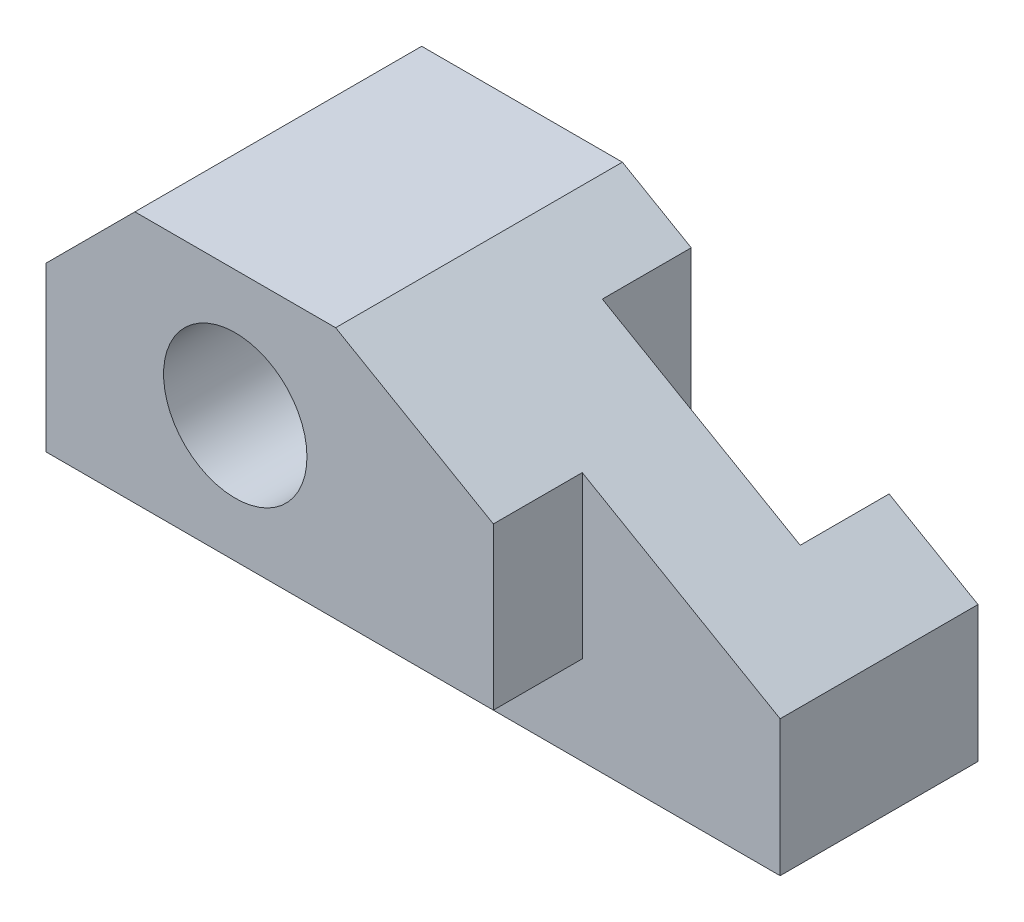
ISO-10303-21;
HEADER;
FILE_DESCRIPTION(('STEP AP214'),'2;1');
FILE_NAME('part.step','',(''),(''),'','','');
FILE_SCHEMA(('AUTOMOTIVE_DESIGN { 1 0 10303 214 1 1 1 1 }'));
ENDSEC;
DATA;
#1=APPLICATION_CONTEXT('core data for automotive mechanical design processes');
#2=APPLICATION_PROTOCOL_DEFINITION('international standard','automotive_design',2000,#1);
#3=PRODUCT_CONTEXT('',#1,'mechanical');
#4=PRODUCT('Part','Part','',(#3));
#5=PRODUCT_RELATED_PRODUCT_CATEGORY('part','',(#4));
#6=PRODUCT_DEFINITION_FORMATION('','',#4);
#7=PRODUCT_DEFINITION_CONTEXT('part definition',#1,'design');
#8=PRODUCT_DEFINITION('design','',#6,#7);
#9=PRODUCT_DEFINITION_SHAPE('','',#8);
#10=(LENGTH_UNIT() NAMED_UNIT(*) SI_UNIT(.MILLI.,.METRE.));
#11=(NAMED_UNIT(*) PLANE_ANGLE_UNIT() SI_UNIT($,.RADIAN.));
#12=(NAMED_UNIT(*) SI_UNIT($,.STERADIAN.) SOLID_ANGLE_UNIT());
#13=UNCERTAINTY_MEASURE_WITH_UNIT(LENGTH_MEASURE(1.E-05),#10,'distance_accuracy_value','');
#14=(GEOMETRIC_REPRESENTATION_CONTEXT(3) GLOBAL_UNCERTAINTY_ASSIGNED_CONTEXT((#13)) GLOBAL_UNIT_ASSIGNED_CONTEXT((#10,
#11,#12)) REPRESENTATION_CONTEXT('',''));
#15=CARTESIAN_POINT('',(0.,0.,0.));
#16=DIRECTION('',(0.,0.,1.));
#17=DIRECTION('',(1.,0.,0.));
#18=AXIS2_PLACEMENT_3D('',#15,#16,#17);
#19=CARTESIAN_POINT('',(0.,0.,-25.4));
#20=DIRECTION('',(0.,0.,1.));
#21=DIRECTION('',(1.,0.,0.));
#22=AXIS2_PLACEMENT_3D('',#19,#20,#21);
#23=PLANE('',#22);
#24=DIRECTION('',(1.,0.,0.));
#25=VECTOR('',#24,1.);
#26=CARTESIAN_POINT('',(0.,0.,-25.4));
#27=LINE('',#26,#25);
#28=CARTESIAN_POINT('',(65.024,0.,-25.4));
#29=VERTEX_POINT('',#28);
#30=CARTESIAN_POINT('',(80.772,0.,-25.4));
#31=VERTEX_POINT('',#30);
#32=EDGE_CURVE('E207',#29,#31,#27,.T.);
#33=ORIENTED_EDGE('',*,*,#32,.F.);
#34=DIRECTION('',(0.,1.,0.));
#35=VECTOR('',#34,1.);
#36=CARTESIAN_POINT('',(65.024,0.,-25.4));
#37=LINE('',#36,#35);
#38=CARTESIAN_POINT('',(65.024,33.1756638824052,-25.4));
#39=VERTEX_POINT('',#38);
#40=EDGE_CURVE('E49',#29,#39,#37,.T.);
#41=ORIENTED_EDGE('',*,*,#40,.T.);
#42=DIRECTION('',(-0.866025403784438,0.500000000000001,0.));
#43=VECTOR('',#42,1.);
#44=CARTESIAN_POINT('',(30.6214838547885,53.0379658396436,-25.4));
#45=LINE('',#44,#43);
#46=CARTESIAN_POINT('',(80.772,24.083551843207,-25.4));
#47=VERTEX_POINT('',#46);
#48=EDGE_CURVE('E213',#47,#39,#45,.T.);
#49=ORIENTED_EDGE('',*,*,#48,.F.);
#50=DIRECTION('',(0.,1.,0.));
#51=VECTOR('',#50,1.);
#52=CARTESIAN_POINT('',(80.772,0.,-25.4));
#53=LINE('',#52,#51);
#54=EDGE_CURVE('E209',#31,#47,#53,.T.);
#55=ORIENTED_EDGE('',*,*,#54,.F.);
#56=EDGE_LOOP('',(#33,#41,#49,#55));
#57=FACE_BOUND('',#56,.T.);
#58=ADVANCED_FACE('F41',(#57),#23,.F.);
#59=CARTESIAN_POINT('',(-33.528,0.,25.4));
#60=DIRECTION('',(1.,0.,0.));
#61=DIRECTION('',(0.,1.,0.));
#62=AXIS2_PLACEMENT_3D('',#59,#60,#61);
#63=PLANE('',#62);
#64=DIRECTION('',(0.,0.,1.));
#65=VECTOR('',#64,1.);
#66=CARTESIAN_POINT('',(-33.528,15.748,9.652));
#67=LINE('',#66,#65);
#68=CARTESIAN_POINT('',(-33.528,15.748,9.652));
#69=VERTEX_POINT('',#68);
#70=CARTESIAN_POINT('',(-33.528,15.748,25.4));
#71=VERTEX_POINT('',#70);
#72=EDGE_CURVE('E184',#69,#71,#67,.T.);
#73=ORIENTED_EDGE('',*,*,#72,.T.);
#74=DIRECTION('',(0.,-1.,0.));
#75=VECTOR('',#74,1.);
#76=CARTESIAN_POINT('',(-33.528,0.,25.4));
#77=LINE('',#76,#75);
#78=CARTESIAN_POINT('',(-33.528,44.7039999999999,25.4));
#79=VERTEX_POINT('',#78);
#80=EDGE_CURVE('E191',#79,#71,#77,.T.);
#81=ORIENTED_EDGE('',*,*,#80,.F.);
#82=DIRECTION('',(0.,0.,-1.));
#83=VECTOR('',#82,1.);
#84=CARTESIAN_POINT('',(-33.528,44.7039999999999,25.4));
#85=LINE('',#84,#83);
#86=CARTESIAN_POINT('',(-33.528,44.7039999999999,-25.4));
#87=VERTEX_POINT('',#86);
#88=EDGE_CURVE('E201',#79,#87,#85,.T.);
#89=ORIENTED_EDGE('',*,*,#88,.T.);
#90=DIRECTION('',(0.,-1.,0.));
#91=VECTOR('',#90,1.);
#92=CARTESIAN_POINT('',(-33.528,0.,-25.4));
#93=LINE('',#92,#91);
#94=CARTESIAN_POINT('',(-33.528,0.,-25.4));
#95=VERTEX_POINT('',#94);
#96=EDGE_CURVE('E204',#87,#95,#93,.T.);
#97=ORIENTED_EDGE('',*,*,#96,.T.);
#98=DIRECTION('',(0.,0.,-1.));
#99=VECTOR('',#98,1.);
#100=CARTESIAN_POINT('',(-33.528,0.,25.4));
#101=LINE('',#100,#99);
#102=CARTESIAN_POINT('',(-33.528,0.,9.652));
#103=VERTEX_POINT('',#102);
#104=EDGE_CURVE('E232',#103,#95,#101,.T.);
#105=ORIENTED_EDGE('',*,*,#104,.F.);
#106=DIRECTION('',(0.,-1.,0.));
#107=VECTOR('',#106,1.);
#108=CARTESIAN_POINT('',(-33.528,0.,9.652));
#109=LINE('',#108,#107);
#110=EDGE_CURVE('E168',#69,#103,#109,.T.);
#111=ORIENTED_EDGE('',*,*,#110,.F.);
#112=EDGE_LOOP('',(#73,#81,#89,#97,#105,#111));
#113=FACE_BOUND('',#112,.T.);
#114=ADVANCED_FACE('F264',(#113),#63,.F.);
#115=CARTESIAN_POINT('',(0.,0.,25.4));
#116=DIRECTION('',(0.,1.,0.));
#117=DIRECTION('',(0.,0.,1.));
#118=AXIS2_PLACEMENT_3D('',#115,#116,#117);
#119=PLANE('',#118);
#120=DIRECTION('',(1.,0.,0.));
#121=VECTOR('',#120,1.);
#122=CARTESIAN_POINT('',(0.,0.,-9.652));
#123=LINE('',#122,#121);
#124=CARTESIAN_POINT('',(29.972,0.,-9.652));
#125=VERTEX_POINT('',#124);
#126=CARTESIAN_POINT('',(65.024,0.,-9.652));
#127=VERTEX_POINT('',#126);
#128=EDGE_CURVE('E139',#125,#127,#123,.T.);
#129=ORIENTED_EDGE('',*,*,#128,.T.);
#130=DIRECTION('',(0.,0.,-1.));
#131=VECTOR('',#130,1.);
#132=CARTESIAN_POINT('',(65.024,0.,25.4));
#133=LINE('',#132,#131);
#134=EDGE_CURVE('E146',#127,#29,#133,.T.);
#135=ORIENTED_EDGE('',*,*,#134,.T.);
#136=ORIENTED_EDGE('',*,*,#32,.T.);
#137=DIRECTION('',(0.,0.,-1.));
#138=VECTOR('',#137,1.);
#139=CARTESIAN_POINT('',(80.772,0.,25.4));
#140=LINE('',#139,#138);
#141=CARTESIAN_POINT('',(80.772,0.,9.652));
#142=VERTEX_POINT('',#141);
#143=EDGE_CURVE('E229',#142,#31,#140,.T.);
#144=ORIENTED_EDGE('',*,*,#143,.F.);
#145=DIRECTION('',(1.,0.,0.));
#146=VECTOR('',#145,1.);
#147=CARTESIAN_POINT('',(0.,0.,9.652));
#148=LINE('',#147,#146);
#149=EDGE_CURVE('E170',#103,#142,#148,.T.);
#150=ORIENTED_EDGE('',*,*,#149,.F.);
#151=ORIENTED_EDGE('',*,*,#104,.T.);
#152=CARTESIAN_POINT('',(29.972,0.,-25.4));
#153=VERTEX_POINT('',#152);
#154=EDGE_CURVE('E155',#95,#153,#27,.T.);
#155=ORIENTED_EDGE('',*,*,#154,.T.);
#156=DIRECTION('',(0.,0.,1.));
#157=VECTOR('',#156,1.);
#158=CARTESIAN_POINT('',(29.972,0.,25.4));
#159=LINE('',#158,#157);
#160=EDGE_CURVE('E56',#153,#125,#159,.T.);
#161=ORIENTED_EDGE('',*,*,#160,.T.);
#162=EDGE_LOOP('',(#129,#135,#136,#144,#150,#151,#155,#161));
#163=FACE_BOUND('',#162,.T.);
#164=ADVANCED_FACE('F153',(#163),#119,.F.);
#165=CARTESIAN_POINT('',(80.772,0.,25.4));
#166=DIRECTION('',(-1.,0.,0.));
#167=DIRECTION('',(0.,0.,1.));
#168=AXIS2_PLACEMENT_3D('',#165,#166,#167);
#169=PLANE('',#168);
#170=DIRECTION('',(0.,1.,0.));
#171=VECTOR('',#170,1.);
#172=CARTESIAN_POINT('',(80.772,0.,9.652));
#173=LINE('',#172,#171);
#174=CARTESIAN_POINT('',(80.772,24.083551843207,9.652));
#175=VERTEX_POINT('',#174);
#176=EDGE_CURVE('E172',#142,#175,#173,.T.);
#177=ORIENTED_EDGE('',*,*,#176,.F.);
#178=ORIENTED_EDGE('',*,*,#143,.T.);
#179=ORIENTED_EDGE('',*,*,#54,.T.);
#180=DIRECTION('',(0.,0.,-1.));
#181=VECTOR('',#180,1.);
#182=CARTESIAN_POINT('',(80.772,24.083551843207,25.4));
#183=LINE('',#182,#181);
#184=EDGE_CURVE('E227',#175,#47,#183,.T.);
#185=ORIENTED_EDGE('',*,*,#184,.F.);
#186=EDGE_LOOP('',(#177,#178,#179,#185));
#187=FACE_BOUND('',#186,.T.);
#188=ADVANCED_FACE('F248',(#187),#169,.F.);
#189=CARTESIAN_POINT('',(30.6214838547885,53.0379658396436,25.4));
#190=DIRECTION('',(-0.500000000000001,-0.866025403784438,0.));
#191=DIRECTION('',(0.866025403784438,-0.500000000000001,0.));
#192=AXIS2_PLACEMENT_3D('',#189,#190,#191);
#193=PLANE('',#192);
#194=ORIENTED_EDGE('',*,*,#48,.T.);
#195=DIRECTION('',(0.,0.,1.));
#196=VECTOR('',#195,1.);
#197=CARTESIAN_POINT('',(65.024,33.1756638824052,25.4));
#198=LINE('',#197,#196);
#199=CARTESIAN_POINT('',(65.024,33.1756638824052,-9.652));
#200=VERTEX_POINT('',#199);
#201=EDGE_CURVE('E156',#39,#200,#198,.T.);
#202=ORIENTED_EDGE('',*,*,#201,.T.);
#203=DIRECTION('',(-0.866025403784438,0.500000000000001,0.));
#204=VECTOR('',#203,1.);
#205=CARTESIAN_POINT('',(30.6214838547885,53.0379658396436,-9.652));
#206=LINE('',#205,#204);
#207=CARTESIAN_POINT('',(29.972,53.41294551804,-9.652));
#208=VERTEX_POINT('',#207);
#209=EDGE_CURVE('E11',#200,#208,#206,.T.);
#210=ORIENTED_EDGE('',*,*,#209,.T.);
#211=DIRECTION('',(0.,0.,-1.));
#212=VECTOR('',#211,1.);
#213=CARTESIAN_POINT('',(29.972,53.4129455180401,25.4));
#214=LINE('',#213,#212);
#215=CARTESIAN_POINT('',(29.972,53.41294551804,-25.4));
#216=VERTEX_POINT('',#215);
#217=EDGE_CURVE('E150',#208,#216,#214,.T.);
#218=ORIENTED_EDGE('',*,*,#217,.T.);
#219=CARTESIAN_POINT('',(17.78,60.452,-25.4));
#220=VERTEX_POINT('',#219);
#221=EDGE_CURVE('E212',#216,#220,#45,.T.);
#222=ORIENTED_EDGE('',*,*,#221,.T.);
#223=DIRECTION('',(0.,0.,-1.));
#224=VECTOR('',#223,1.);
#225=CARTESIAN_POINT('',(17.78,60.452,25.4));
#226=LINE('',#225,#224);
#227=CARTESIAN_POINT('',(17.78,60.452,25.4));
#228=VERTEX_POINT('',#227);
#229=EDGE_CURVE('E224',#228,#220,#226,.T.);
#230=ORIENTED_EDGE('',*,*,#229,.F.);
#231=DIRECTION('',(-0.866025403784438,0.500000000000001,0.));
#232=VECTOR('',#231,1.);
#233=CARTESIAN_POINT('',(30.6214838547885,53.0379658396436,25.4));
#234=LINE('',#233,#232);
#235=CARTESIAN_POINT('',(45.72,44.3208334788418,25.4));
#236=VERTEX_POINT('',#235);
#237=EDGE_CURVE('E195',#236,#228,#234,.T.);
#238=ORIENTED_EDGE('',*,*,#237,.F.);
#239=DIRECTION('',(0.,0.,1.));
#240=VECTOR('',#239,1.);
#241=CARTESIAN_POINT('',(45.72,44.3208334788418,9.652));
#242=LINE('',#241,#240);
#243=CARTESIAN_POINT('',(45.72,44.3208334788418,9.652));
#244=VERTEX_POINT('',#243);
#245=EDGE_CURVE('E181',#244,#236,#242,.T.);
#246=ORIENTED_EDGE('',*,*,#245,.F.);
#247=DIRECTION('',(-0.866025403784438,0.500000000000001,0.));
#248=VECTOR('',#247,1.);
#249=CARTESIAN_POINT('',(30.6214838547885,53.0379658396436,9.652));
#250=LINE('',#249,#248);
#251=EDGE_CURVE('E174',#175,#244,#250,.T.);
#252=ORIENTED_EDGE('',*,*,#251,.F.);
#253=ORIENTED_EDGE('',*,*,#184,.T.);
#254=EDGE_LOOP('',(#194,#202,#210,#218,#222,#230,#238,#246,#252,#253));
#255=FACE_BOUND('',#254,.T.);
#256=ADVANCED_FACE('F242',(#255),#193,.F.);
#257=CARTESIAN_POINT('',(0.,0.,25.4));
#258=DIRECTION('',(0.,0.,1.));
#259=DIRECTION('',(1.,0.,0.));
#260=AXIS2_PLACEMENT_3D('',#257,#258,#259);
#261=PLANE('',#260);
#262=CARTESIAN_POINT('',(0.,38.1,25.4));
#263=DIRECTION('',(0.,0.,1.));
#264=DIRECTION('',(1.,0.,0.));
#265=AXIS2_PLACEMENT_3D('',#262,#263,#264);
#266=CIRCLE('',#265,12.7);
#267=CARTESIAN_POINT('',(12.7,38.1,25.4));
#268=VERTEX_POINT('',#267);
#269=EDGE_CURVE('E188',#268,#268,#266,.T.);
#270=ORIENTED_EDGE('',*,*,#269,.F.);
#271=EDGE_LOOP('',(#270));
#272=FACE_BOUND('',#271,.T.);
#273=DIRECTION('',(1.,0.,0.));
#274=VECTOR('',#273,1.);
#275=CARTESIAN_POINT('',(0.,15.748,25.4));
#276=LINE('',#275,#274);
#277=CARTESIAN_POINT('',(45.72,15.748,25.4));
#278=VERTEX_POINT('',#277);
#279=EDGE_CURVE('E166',#71,#278,#276,.T.);
#280=ORIENTED_EDGE('',*,*,#279,.T.);
#281=DIRECTION('',(0.,1.,0.));
#282=VECTOR('',#281,1.);
#283=CARTESIAN_POINT('',(45.72,0.,25.4));
#284=LINE('',#283,#282);
#285=EDGE_CURVE('E64',#278,#236,#284,.T.);
#286=ORIENTED_EDGE('',*,*,#285,.T.);
#287=ORIENTED_EDGE('',*,*,#237,.T.);
#288=DIRECTION('',(-1.,0.,0.));
#289=VECTOR('',#288,1.);
#290=CARTESIAN_POINT('',(0.,60.452,25.4));
#291=LINE('',#290,#289);
#292=CARTESIAN_POINT('',(-17.78,60.452,25.4));
#293=VERTEX_POINT('',#292);
#294=EDGE_CURVE('E197',#228,#293,#291,.T.);
#295=ORIENTED_EDGE('',*,*,#294,.T.);
#296=DIRECTION('',(-0.707106781186546,-0.707106781186549,0.));
#297=VECTOR('',#296,1.);
#298=CARTESIAN_POINT('',(-39.116,39.1159999999999,25.4));
#299=LINE('',#298,#297);
#300=EDGE_CURVE('E199',#293,#79,#299,.T.);
#301=ORIENTED_EDGE('',*,*,#300,.T.);
#302=ORIENTED_EDGE('',*,*,#80,.T.);
#303=EDGE_LOOP('',(#280,#286,#287,#295,#301,#302));
#304=FACE_BOUND('',#303,.T.);
#305=ADVANCED_FACE('F297',(#272,#304),#261,.T.);
#306=CARTESIAN_POINT('',(0.,60.452,25.4));
#307=DIRECTION('',(0.,-1.,0.));
#308=DIRECTION('',(0.,0.,-1.));
#309=AXIS2_PLACEMENT_3D('',#306,#307,#308);
#310=PLANE('',#309);
#311=DIRECTION('',(-1.,0.,0.));
#312=VECTOR('',#311,1.);
#313=CARTESIAN_POINT('',(0.,60.452,-25.4));
#314=LINE('',#313,#312);
#315=CARTESIAN_POINT('',(-17.78,60.452,-25.4));
#316=VERTEX_POINT('',#315);
#317=EDGE_CURVE('E216',#220,#316,#314,.T.);
#318=ORIENTED_EDGE('',*,*,#317,.T.);
#319=DIRECTION('',(0.,0.,-1.));
#320=VECTOR('',#319,1.);
#321=CARTESIAN_POINT('',(-17.78,60.452,25.4));
#322=LINE('',#321,#320);
#323=EDGE_CURVE('E221',#293,#316,#322,.T.);
#324=ORIENTED_EDGE('',*,*,#323,.F.);
#325=ORIENTED_EDGE('',*,*,#294,.F.);
#326=ORIENTED_EDGE('',*,*,#229,.T.);
#327=EDGE_LOOP('',(#318,#324,#325,#326));
#328=FACE_BOUND('',#327,.T.);
#329=ADVANCED_FACE('F293',(#328),#310,.F.);
#330=CARTESIAN_POINT('',(0.,38.1,25.4));
#331=DIRECTION('',(0.,0.,-1.));
#332=DIRECTION('',(-1.,0.,0.));
#333=AXIS2_PLACEMENT_3D('',#330,#331,#332);
#334=CYLINDRICAL_SURFACE('',#333,12.7);
#335=ORIENTED_EDGE('',*,*,#269,.T.);
#336=EDGE_LOOP('',(#335));
#337=FACE_BOUND('',#336,.T.);
#338=CARTESIAN_POINT('',(0.,38.1,-25.4));
#339=DIRECTION('',(0.,0.,1.));
#340=DIRECTION('',(1.,0.,0.));
#341=AXIS2_PLACEMENT_3D('',#338,#339,#340);
#342=CIRCLE('',#341,12.7);
#343=CARTESIAN_POINT('',(12.7,38.1,-25.4));
#344=VERTEX_POINT('',#343);
#345=EDGE_CURVE('E183',#344,#344,#342,.T.);
#346=ORIENTED_EDGE('',*,*,#345,.F.);
#347=EDGE_LOOP('',(#346));
#348=FACE_BOUND('',#347,.T.);
#349=ADVANCED_FACE('F43',(#337,#348),#334,.F.);
#350=CARTESIAN_POINT('',(-39.116,39.1159999999999,25.4));
#351=DIRECTION('',(0.707106781186549,-0.707106781186546,0.));
#352=DIRECTION('',(0.707106781186546,0.707106781186549,0.));
#353=AXIS2_PLACEMENT_3D('',#350,#351,#352);
#354=PLANE('',#353);
#355=DIRECTION('',(-0.707106781186546,-0.707106781186549,0.));
#356=VECTOR('',#355,1.);
#357=CARTESIAN_POINT('',(-39.116,39.1159999999999,-25.4));
#358=LINE('',#357,#356);
#359=EDGE_CURVE('E192',#316,#87,#358,.T.);
#360=ORIENTED_EDGE('',*,*,#359,.T.);
#361=ORIENTED_EDGE('',*,*,#88,.F.);
#362=ORIENTED_EDGE('',*,*,#300,.F.);
#363=ORIENTED_EDGE('',*,*,#323,.T.);
#364=EDGE_LOOP('',(#360,#361,#362,#363));
#365=FACE_BOUND('',#364,.T.);
#366=ADVANCED_FACE('F275',(#365),#354,.F.);
#367=ORIENTED_EDGE('',*,*,#345,.T.);
#368=EDGE_LOOP('',(#367));
#369=FACE_BOUND('',#368,.T.);
#370=ORIENTED_EDGE('',*,*,#221,.F.);
#371=DIRECTION('',(0.,-1.,0.));
#372=VECTOR('',#371,1.);
#373=CARTESIAN_POINT('',(29.972,0.,-25.4));
#374=LINE('',#373,#372);
#375=EDGE_CURVE('E234',#216,#153,#374,.T.);
#376=ORIENTED_EDGE('',*,*,#375,.T.);
#377=ORIENTED_EDGE('',*,*,#154,.F.);
#378=ORIENTED_EDGE('',*,*,#96,.F.);
#379=ORIENTED_EDGE('',*,*,#359,.F.);
#380=ORIENTED_EDGE('',*,*,#317,.F.);
#381=EDGE_LOOP('',(#370,#376,#377,#378,#379,#380));
#382=FACE_BOUND('',#381,.T.);
#383=ADVANCED_FACE('F266',(#369,#382),#23,.F.);
#384=CARTESIAN_POINT('',(45.72,0.,9.652));
#385=DIRECTION('',(1.,0.,0.));
#386=DIRECTION('',(0.,1.,0.));
#387=AXIS2_PLACEMENT_3D('',#384,#385,#386);
#388=PLANE('',#387);
#389=ORIENTED_EDGE('',*,*,#285,.F.);
#390=DIRECTION('',(0.,0.,1.));
#391=VECTOR('',#390,1.);
#392=CARTESIAN_POINT('',(45.72,15.748,9.652));
#393=LINE('',#392,#391);
#394=CARTESIAN_POINT('',(45.72,15.748,9.652));
#395=VERTEX_POINT('',#394);
#396=EDGE_CURVE('E177',#395,#278,#393,.T.);
#397=ORIENTED_EDGE('',*,*,#396,.F.);
#398=DIRECTION('',(0.,1.,0.));
#399=VECTOR('',#398,1.);
#400=CARTESIAN_POINT('',(45.72,0.,9.652));
#401=LINE('',#400,#399);
#402=EDGE_CURVE('E163',#395,#244,#401,.T.);
#403=ORIENTED_EDGE('',*,*,#402,.T.);
#404=ORIENTED_EDGE('',*,*,#245,.T.);
#405=EDGE_LOOP('',(#389,#397,#403,#404));
#406=FACE_BOUND('',#405,.T.);
#407=ADVANCED_FACE('F274',(#406),#388,.T.);
#408=CARTESIAN_POINT('',(0.,15.748,9.652));
#409=DIRECTION('',(0.,-1.,0.));
#410=DIRECTION('',(0.,0.,-1.));
#411=AXIS2_PLACEMENT_3D('',#408,#409,#410);
#412=PLANE('',#411);
#413=ORIENTED_EDGE('',*,*,#279,.F.);
#414=ORIENTED_EDGE('',*,*,#72,.F.);
#415=DIRECTION('',(1.,0.,0.));
#416=VECTOR('',#415,1.);
#417=CARTESIAN_POINT('',(0.,15.748,9.652));
#418=LINE('',#417,#416);
#419=EDGE_CURVE('E165',#69,#395,#418,.T.);
#420=ORIENTED_EDGE('',*,*,#419,.T.);
#421=ORIENTED_EDGE('',*,*,#396,.T.);
#422=EDGE_LOOP('',(#413,#414,#420,#421));
#423=FACE_BOUND('',#422,.T.);
#424=ADVANCED_FACE('F281',(#423),#412,.T.);
#425=CARTESIAN_POINT('',(0.,0.,9.652));
#426=DIRECTION('',(0.,0.,1.));
#427=DIRECTION('',(1.,0.,0.));
#428=AXIS2_PLACEMENT_3D('',#425,#426,#427);
#429=PLANE('',#428);
#430=ORIENTED_EDGE('',*,*,#402,.F.);
#431=ORIENTED_EDGE('',*,*,#419,.F.);
#432=ORIENTED_EDGE('',*,*,#110,.T.);
#433=ORIENTED_EDGE('',*,*,#149,.T.);
#434=ORIENTED_EDGE('',*,*,#176,.T.);
#435=ORIENTED_EDGE('',*,*,#251,.T.);
#436=EDGE_LOOP('',(#430,#431,#432,#433,#434,#435));
#437=FACE_BOUND('',#436,.T.);
#438=ADVANCED_FACE('F261',(#437),#429,.T.);
#439=CARTESIAN_POINT('',(29.972,-1.2E-05,-9.652));
#440=DIRECTION('',(0.,0.,1.));
#441=DIRECTION('',(1.,0.,0.));
#442=AXIS2_PLACEMENT_3D('',#439,#440,#441);
#443=PLANE('',#442);
#444=DIRECTION('',(0.,1.,0.));
#445=VECTOR('',#444,1.);
#446=CARTESIAN_POINT('',(29.972,-1.2E-05,-9.652));
#447=LINE('',#446,#445);
#448=EDGE_CURVE('E141',#125,#208,#447,.T.);
#449=ORIENTED_EDGE('',*,*,#448,.T.);
#450=ORIENTED_EDGE('',*,*,#209,.F.);
#451=DIRECTION('',(0.,1.,0.));
#452=VECTOR('',#451,1.);
#453=CARTESIAN_POINT('',(65.024,-1.2E-05,-9.652));
#454=LINE('',#453,#452);
#455=EDGE_CURVE('E143',#127,#200,#454,.T.);
#456=ORIENTED_EDGE('',*,*,#455,.F.);
#457=ORIENTED_EDGE('',*,*,#128,.F.);
#458=EDGE_LOOP('',(#449,#450,#456,#457));
#459=FACE_BOUND('',#458,.T.);
#460=ADVANCED_FACE('F140',(#459),#443,.F.);
#461=CARTESIAN_POINT('',(65.024,-1.2E-05,-9.652));
#462=DIRECTION('',(1.,0.,0.));
#463=DIRECTION('',(0.,0.,-1.));
#464=AXIS2_PLACEMENT_3D('',#461,#462,#463);
#465=PLANE('',#464);
#466=ORIENTED_EDGE('',*,*,#455,.T.);
#467=ORIENTED_EDGE('',*,*,#201,.F.);
#468=ORIENTED_EDGE('',*,*,#40,.F.);
#469=ORIENTED_EDGE('',*,*,#134,.F.);
#470=EDGE_LOOP('',(#466,#467,#468,#469));
#471=FACE_BOUND('',#470,.T.);
#472=ADVANCED_FACE('F252',(#471),#465,.F.);
#473=CARTESIAN_POINT('',(29.972,-1.2E-05,-25.4));
#474=DIRECTION('',(-1.,0.,0.));
#475=DIRECTION('',(0.,0.,1.));
#476=AXIS2_PLACEMENT_3D('',#473,#474,#475);
#477=PLANE('',#476);
#478=ORIENTED_EDGE('',*,*,#375,.F.);
#479=ORIENTED_EDGE('',*,*,#217,.F.);
#480=ORIENTED_EDGE('',*,*,#448,.F.);
#481=ORIENTED_EDGE('',*,*,#160,.F.);
#482=EDGE_LOOP('',(#478,#479,#480,#481));
#483=FACE_BOUND('',#482,.T.);
#484=ADVANCED_FACE('F148',(#483),#477,.F.);
#485=CLOSED_SHELL('',(#58,#114,#164,#188,#256,#305,#329,#349,#366,#383,#407,#424,#438,#460,#472,#484));
#486=MANIFOLD_SOLID_BREP('B2',#485);
#487=ADVANCED_BREP_SHAPE_REPRESENTATION('',(#18,#486),#14);
#488=SHAPE_DEFINITION_REPRESENTATION(#9,#487);
ENDSEC;
END-ISO-10303-21;
